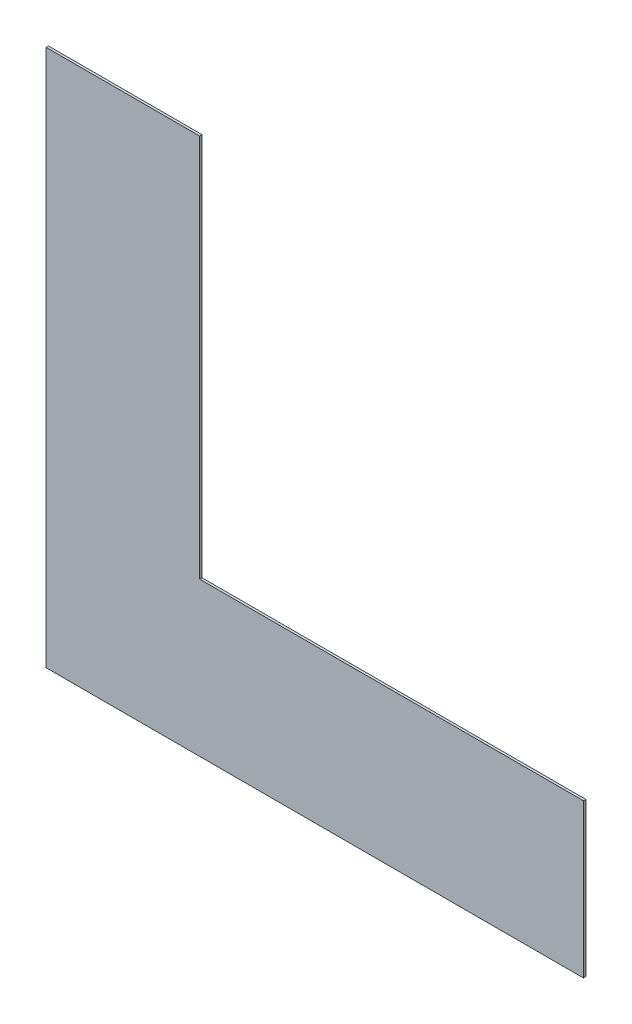
ISO-10303-21;
HEADER;
FILE_DESCRIPTION(('STEP AP214'),'2;1');
FILE_NAME('part.step','',(''),(''),'','','');
FILE_SCHEMA(('AUTOMOTIVE_DESIGN { 1 0 10303 214 1 1 1 1 }'));
ENDSEC;
DATA;
#1=APPLICATION_CONTEXT('core data for automotive mechanical design processes');
#2=APPLICATION_PROTOCOL_DEFINITION('international standard','automotive_design',2000,#1);
#3=PRODUCT_CONTEXT('',#1,'mechanical');
#4=PRODUCT('Part','Part','',(#3));
#5=PRODUCT_RELATED_PRODUCT_CATEGORY('part','',(#4));
#6=PRODUCT_DEFINITION_FORMATION('','',#4);
#7=PRODUCT_DEFINITION_CONTEXT('part definition',#1,'design');
#8=PRODUCT_DEFINITION('design','',#6,#7);
#9=PRODUCT_DEFINITION_SHAPE('','',#8);
#10=(LENGTH_UNIT() NAMED_UNIT(*) SI_UNIT(.MILLI.,.METRE.));
#11=(NAMED_UNIT(*) PLANE_ANGLE_UNIT() SI_UNIT($,.RADIAN.));
#12=(NAMED_UNIT(*) SI_UNIT($,.STERADIAN.) SOLID_ANGLE_UNIT());
#13=UNCERTAINTY_MEASURE_WITH_UNIT(LENGTH_MEASURE(1.E-05),#10,'distance_accuracy_value','');
#14=(GEOMETRIC_REPRESENTATION_CONTEXT(3) GLOBAL_UNCERTAINTY_ASSIGNED_CONTEXT((#13)) GLOBAL_UNIT_ASSIGNED_CONTEXT((#10,
#11,#12)) REPRESENTATION_CONTEXT('',''));
#15=CARTESIAN_POINT('',(0.,0.,0.));
#16=DIRECTION('',(0.,0.,1.));
#17=DIRECTION('',(1.,0.,0.));
#18=AXIS2_PLACEMENT_3D('',#15,#16,#17);
#19=CARTESIAN_POINT('',(0.,0.,0.79375));
#20=DIRECTION('',(0.,0.,1.));
#21=DIRECTION('',(1.,0.,0.));
#22=AXIS2_PLACEMENT_3D('',#19,#20,#21);
#23=PLANE('',#22);
#24=DIRECTION('',(0.,1.,0.));
#25=VECTOR('',#24,1.);
#26=CARTESIAN_POINT('',(0.,177.8,0.79375));
#27=LINE('',#26,#25);
#28=CARTESIAN_POINT('',(0.,0.,0.79375));
#29=VERTEX_POINT('',#28);
#30=CARTESIAN_POINT('',(0.,177.8,0.79375));
#31=VERTEX_POINT('',#30);
#32=EDGE_CURVE('E81',#29,#31,#27,.T.);
#33=ORIENTED_EDGE('',*,*,#32,.F.);
#34=DIRECTION('',(1.,0.,0.));
#35=VECTOR('',#34,1.);
#36=CARTESIAN_POINT('',(0.,0.,0.79375));
#37=LINE('',#36,#35);
#38=CARTESIAN_POINT('',(177.8,0.,0.79375));
#39=VERTEX_POINT('',#38);
#40=EDGE_CURVE('E19',#39,#29,#37,.F.);
#41=ORIENTED_EDGE('',*,*,#40,.F.);
#42=DIRECTION('',(0.,1.,0.));
#43=VECTOR('',#42,1.);
#44=CARTESIAN_POINT('',(177.8,0.,0.79375));
#45=LINE('',#44,#43);
#46=CARTESIAN_POINT('',(177.8,50.8,0.79375));
#47=VERTEX_POINT('',#46);
#48=EDGE_CURVE('E70',#47,#39,#45,.F.);
#49=ORIENTED_EDGE('',*,*,#48,.F.);
#50=DIRECTION('',(1.,0.,0.));
#51=VECTOR('',#50,1.);
#52=CARTESIAN_POINT('',(177.8,50.8,0.79375));
#53=LINE('',#52,#51);
#54=CARTESIAN_POINT('',(50.8,50.8,0.79375));
#55=VERTEX_POINT('',#54);
#56=EDGE_CURVE('E65',#55,#47,#53,.T.);
#57=ORIENTED_EDGE('',*,*,#56,.F.);
#58=DIRECTION('',(0.,1.,0.));
#59=VECTOR('',#58,1.);
#60=CARTESIAN_POINT('',(50.8,50.8,0.79375));
#61=LINE('',#60,#59);
#62=CARTESIAN_POINT('',(50.8,177.8,0.79375));
#63=VERTEX_POINT('',#62);
#64=EDGE_CURVE('E92',#63,#55,#61,.F.);
#65=ORIENTED_EDGE('',*,*,#64,.F.);
#66=DIRECTION('',(1.,0.,0.));
#67=VECTOR('',#66,1.);
#68=CARTESIAN_POINT('',(50.8,177.8,0.79375));
#69=LINE('',#68,#67);
#70=EDGE_CURVE('E96',#31,#63,#69,.T.);
#71=ORIENTED_EDGE('',*,*,#70,.F.);
#72=EDGE_LOOP('',(#33,#41,#49,#57,#65,#71));
#73=FACE_BOUND('',#72,.T.);
#74=ADVANCED_FACE('F16',(#73),#23,.T.);
#75=CARTESIAN_POINT('',(0.,0.,0.));
#76=DIRECTION('',(0.,-1.,0.));
#77=DIRECTION('',(0.,0.,-1.));
#78=AXIS2_PLACEMENT_3D('',#75,#76,#77);
#79=PLANE('',#78);
#80=DIRECTION('',(0.,0.,1.));
#81=VECTOR('',#80,1.);
#82=CARTESIAN_POINT('',(0.,0.,0.));
#83=LINE('',#82,#81);
#84=CARTESIAN_POINT('',(0.,0.,0.));
#85=VERTEX_POINT('',#84);
#86=EDGE_CURVE('E100',#85,#29,#83,.T.);
#87=ORIENTED_EDGE('',*,*,#86,.F.);
#88=DIRECTION('',(1.,0.,0.));
#89=VECTOR('',#88,1.);
#90=CARTESIAN_POINT('',(0.,0.,0.));
#91=LINE('',#90,#89);
#92=CARTESIAN_POINT('',(177.8,0.,0.));
#93=VERTEX_POINT('',#92);
#94=EDGE_CURVE('E87',#85,#93,#91,.T.);
#95=ORIENTED_EDGE('',*,*,#94,.T.);
#96=DIRECTION('',(0.,0.,-1.));
#97=VECTOR('',#96,1.);
#98=CARTESIAN_POINT('',(177.8,0.,0.));
#99=LINE('',#98,#97);
#100=EDGE_CURVE('E75',#39,#93,#99,.T.);
#101=ORIENTED_EDGE('',*,*,#100,.F.);
#102=ORIENTED_EDGE('',*,*,#40,.T.);
#103=EDGE_LOOP('',(#87,#95,#101,#102));
#104=FACE_BOUND('',#103,.T.);
#105=ADVANCED_FACE('F86',(#104),#79,.T.);
#106=CARTESIAN_POINT('',(177.8,0.,0.));
#107=DIRECTION('',(1.,0.,0.));
#108=DIRECTION('',(0.,0.,-1.));
#109=AXIS2_PLACEMENT_3D('',#106,#107,#108);
#110=PLANE('',#109);
#111=ORIENTED_EDGE('',*,*,#100,.T.);
#112=DIRECTION('',(0.,1.,0.));
#113=VECTOR('',#112,1.);
#114=CARTESIAN_POINT('',(177.8,0.,0.));
#115=LINE('',#114,#113);
#116=CARTESIAN_POINT('',(177.8,50.8,0.));
#117=VERTEX_POINT('',#116);
#118=EDGE_CURVE('E105',#93,#117,#115,.T.);
#119=ORIENTED_EDGE('',*,*,#118,.T.);
#120=DIRECTION('',(0.,0.,1.));
#121=VECTOR('',#120,1.);
#122=CARTESIAN_POINT('',(177.8,50.8,0.));
#123=LINE('',#122,#121);
#124=EDGE_CURVE('E77',#47,#117,#123,.F.);
#125=ORIENTED_EDGE('',*,*,#124,.F.);
#126=ORIENTED_EDGE('',*,*,#48,.T.);
#127=EDGE_LOOP('',(#111,#119,#125,#126));
#128=FACE_BOUND('',#127,.T.);
#129=ADVANCED_FACE('F72',(#128),#110,.T.);
#130=CARTESIAN_POINT('',(177.8,50.8,0.));
#131=DIRECTION('',(0.,1.,0.));
#132=DIRECTION('',(0.,0.,1.));
#133=AXIS2_PLACEMENT_3D('',#130,#131,#132);
#134=PLANE('',#133);
#135=ORIENTED_EDGE('',*,*,#124,.T.);
#136=DIRECTION('',(1.,0.,0.));
#137=VECTOR('',#136,1.);
#138=CARTESIAN_POINT('',(0.,50.8,0.));
#139=LINE('',#138,#137);
#140=CARTESIAN_POINT('',(50.8,50.8,0.));
#141=VERTEX_POINT('',#140);
#142=EDGE_CURVE('E107',#117,#141,#139,.F.);
#143=ORIENTED_EDGE('',*,*,#142,.T.);
#144=DIRECTION('',(0.,0.,-1.));
#145=VECTOR('',#144,1.);
#146=CARTESIAN_POINT('',(50.8,50.8,0.));
#147=LINE('',#146,#145);
#148=EDGE_CURVE('E94',#55,#141,#147,.T.);
#149=ORIENTED_EDGE('',*,*,#148,.F.);
#150=ORIENTED_EDGE('',*,*,#56,.T.);
#151=EDGE_LOOP('',(#135,#143,#149,#150));
#152=FACE_BOUND('',#151,.T.);
#153=ADVANCED_FACE('F125',(#152),#134,.T.);
#154=CARTESIAN_POINT('',(50.8,50.8,0.));
#155=DIRECTION('',(1.,0.,0.));
#156=DIRECTION('',(0.,0.,-1.));
#157=AXIS2_PLACEMENT_3D('',#154,#155,#156);
#158=PLANE('',#157);
#159=ORIENTED_EDGE('',*,*,#148,.T.);
#160=DIRECTION('',(0.,1.,0.));
#161=VECTOR('',#160,1.);
#162=CARTESIAN_POINT('',(50.8,0.,0.));
#163=LINE('',#162,#161);
#164=CARTESIAN_POINT('',(50.8,177.8,0.));
#165=VERTEX_POINT('',#164);
#166=EDGE_CURVE('E110',#141,#165,#163,.T.);
#167=ORIENTED_EDGE('',*,*,#166,.T.);
#168=DIRECTION('',(0.,0.,1.));
#169=VECTOR('',#168,1.);
#170=CARTESIAN_POINT('',(50.8,177.8,0.));
#171=LINE('',#170,#169);
#172=EDGE_CURVE('E98',#63,#165,#171,.F.);
#173=ORIENTED_EDGE('',*,*,#172,.F.);
#174=ORIENTED_EDGE('',*,*,#64,.T.);
#175=EDGE_LOOP('',(#159,#167,#173,#174));
#176=FACE_BOUND('',#175,.T.);
#177=ADVANCED_FACE('F123',(#176),#158,.T.);
#178=CARTESIAN_POINT('',(50.8,177.8,0.));
#179=DIRECTION('',(0.,1.,0.));
#180=DIRECTION('',(0.,0.,1.));
#181=AXIS2_PLACEMENT_3D('',#178,#179,#180);
#182=PLANE('',#181);
#183=ORIENTED_EDGE('',*,*,#172,.T.);
#184=DIRECTION('',(1.,0.,0.));
#185=VECTOR('',#184,1.);
#186=CARTESIAN_POINT('',(0.,177.8,0.));
#187=LINE('',#186,#185);
#188=CARTESIAN_POINT('',(0.,177.8,0.));
#189=VERTEX_POINT('',#188);
#190=EDGE_CURVE('E25',#165,#189,#187,.F.);
#191=ORIENTED_EDGE('',*,*,#190,.T.);
#192=DIRECTION('',(0.,0.,1.));
#193=VECTOR('',#192,1.);
#194=CARTESIAN_POINT('',(0.,177.8,0.));
#195=LINE('',#194,#193);
#196=EDGE_CURVE('E33',#31,#189,#195,.F.);
#197=ORIENTED_EDGE('',*,*,#196,.F.);
#198=ORIENTED_EDGE('',*,*,#70,.T.);
#199=EDGE_LOOP('',(#183,#191,#197,#198));
#200=FACE_BOUND('',#199,.T.);
#201=ADVANCED_FACE('F116',(#200),#182,.T.);
#202=CARTESIAN_POINT('',(0.,177.8,0.));
#203=DIRECTION('',(-1.,0.,0.));
#204=DIRECTION('',(0.,0.,1.));
#205=AXIS2_PLACEMENT_3D('',#202,#203,#204);
#206=PLANE('',#205);
#207=ORIENTED_EDGE('',*,*,#196,.T.);
#208=DIRECTION('',(0.,1.,0.));
#209=VECTOR('',#208,1.);
#210=CARTESIAN_POINT('',(0.,0.,0.));
#211=LINE('',#210,#209);
#212=EDGE_CURVE('E11',#189,#85,#211,.F.);
#213=ORIENTED_EDGE('',*,*,#212,.T.);
#214=ORIENTED_EDGE('',*,*,#86,.T.);
#215=ORIENTED_EDGE('',*,*,#32,.T.);
#216=EDGE_LOOP('',(#207,#213,#214,#215));
#217=FACE_BOUND('',#216,.T.);
#218=ADVANCED_FACE('F126',(#217),#206,.T.);
#219=CARTESIAN_POINT('',(0.,0.,0.));
#220=DIRECTION('',(0.,0.,1.));
#221=DIRECTION('',(1.,0.,0.));
#222=AXIS2_PLACEMENT_3D('',#219,#220,#221);
#223=PLANE('',#222);
#224=ORIENTED_EDGE('',*,*,#190,.F.);
#225=ORIENTED_EDGE('',*,*,#166,.F.);
#226=ORIENTED_EDGE('',*,*,#142,.F.);
#227=ORIENTED_EDGE('',*,*,#118,.F.);
#228=ORIENTED_EDGE('',*,*,#94,.F.);
#229=ORIENTED_EDGE('',*,*,#212,.F.);
#230=EDGE_LOOP('',(#224,#225,#226,#227,#228,#229));
#231=FACE_BOUND('',#230,.T.);
#232=ADVANCED_FACE('F120',(#231),#223,.F.);
#233=CLOSED_SHELL('',(#74,#105,#129,#153,#177,#201,#218,#232));
#234=MANIFOLD_SOLID_BREP('B1',#233);
#235=ADVANCED_BREP_SHAPE_REPRESENTATION('',(#18,#234),#14);
#236=SHAPE_DEFINITION_REPRESENTATION(#9,#235);
ENDSEC;
END-ISO-10303-21;
